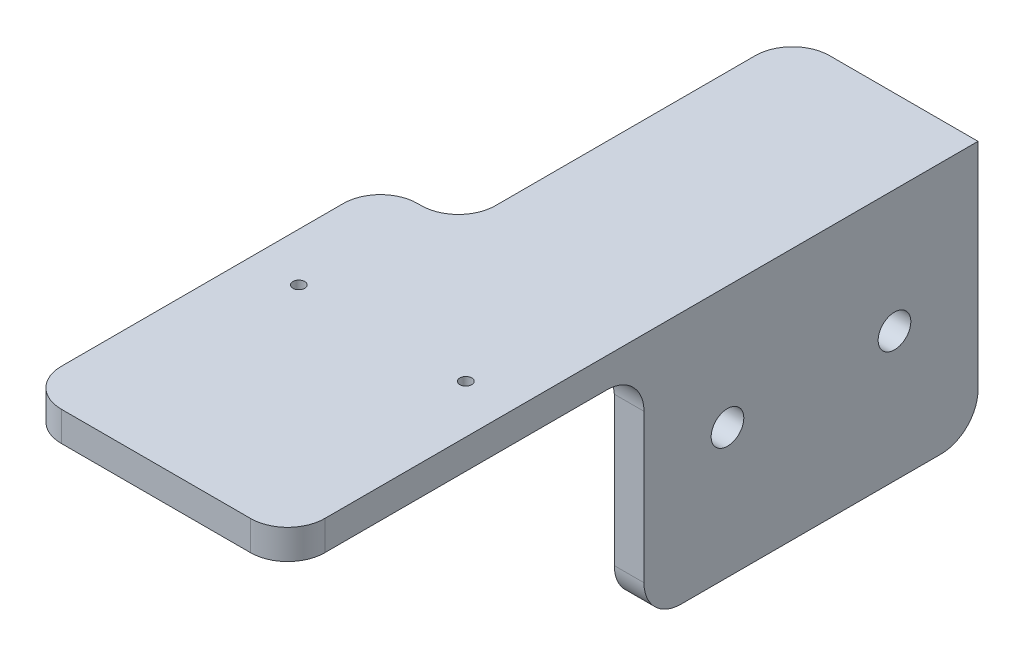
ISO-10303-21;
HEADER;
FILE_DESCRIPTION(('STEP AP214'),'2;1');
FILE_NAME('part.step','',(''),(''),'','','');
FILE_SCHEMA(('AUTOMOTIVE_DESIGN { 1 0 10303 214 1 1 1 1 }'));
ENDSEC;
DATA;
#1=APPLICATION_CONTEXT('core data for automotive mechanical design processes');
#2=APPLICATION_PROTOCOL_DEFINITION('international standard','automotive_design',2000,#1);
#3=PRODUCT_CONTEXT('',#1,'mechanical');
#4=PRODUCT('Part','Part','',(#3));
#5=PRODUCT_RELATED_PRODUCT_CATEGORY('part','',(#4));
#6=PRODUCT_DEFINITION_FORMATION('','',#4);
#7=PRODUCT_DEFINITION_CONTEXT('part definition',#1,'design');
#8=PRODUCT_DEFINITION('design','',#6,#7);
#9=PRODUCT_DEFINITION_SHAPE('','',#8);
#10=(LENGTH_UNIT() NAMED_UNIT(*) SI_UNIT(.MILLI.,.METRE.));
#11=(NAMED_UNIT(*) PLANE_ANGLE_UNIT() SI_UNIT($,.RADIAN.));
#12=(NAMED_UNIT(*) SI_UNIT($,.STERADIAN.) SOLID_ANGLE_UNIT());
#13=UNCERTAINTY_MEASURE_WITH_UNIT(LENGTH_MEASURE(1.E-05),#10,'distance_accuracy_value','');
#14=(GEOMETRIC_REPRESENTATION_CONTEXT(3) GLOBAL_UNCERTAINTY_ASSIGNED_CONTEXT((#13)) GLOBAL_UNIT_ASSIGNED_CONTEXT((#10,
#11,#12)) REPRESENTATION_CONTEXT('',''));
#15=CARTESIAN_POINT('',(0.,0.,0.));
#16=DIRECTION('',(0.,0.,1.));
#17=DIRECTION('',(1.,0.,0.));
#18=AXIS2_PLACEMENT_3D('',#15,#16,#17);
#19=CARTESIAN_POINT('',(35.5,-10.,-38.));
#20=DIRECTION('',(1.,0.,0.));
#21=DIRECTION('',(0.,0.,-1.));
#22=AXIS2_PLACEMENT_3D('',#19,#20,#21);
#23=CYLINDRICAL_SURFACE('',#22,10.);
#24=DIRECTION('',(-1.,0.,0.));
#25=VECTOR('',#24,1.);
#26=CARTESIAN_POINT('',(35.5,-10.,-48.));
#27=LINE('',#26,#25);
#28=CARTESIAN_POINT('',(35.5,-10.,-48.));
#29=VERTEX_POINT('',#28);
#30=CARTESIAN_POINT('',(27.5,-10.,-48.));
#31=VERTEX_POINT('',#30);
#32=EDGE_CURVE('E218',#29,#31,#27,.T.);
#33=ORIENTED_EDGE('',*,*,#32,.F.);
#34=CARTESIAN_POINT('',(35.5,-10.,-38.));
#35=DIRECTION('',(-1.,0.,0.));
#36=DIRECTION('',(0.,0.,1.));
#37=AXIS2_PLACEMENT_3D('',#34,#35,#36);
#38=CIRCLE('',#37,10.);
#39=CARTESIAN_POINT('',(35.5,0.,-38.));
#40=VERTEX_POINT('',#39);
#41=EDGE_CURVE('E46',#29,#40,#38,.F.);
#42=ORIENTED_EDGE('',*,*,#41,.T.);
#43=DIRECTION('',(-1.,0.,0.));
#44=VECTOR('',#43,1.);
#45=CARTESIAN_POINT('',(35.5,0.,-38.));
#46=LINE('',#45,#44);
#47=CARTESIAN_POINT('',(17.5,0.,-38.));
#48=VERTEX_POINT('',#47);
#49=EDGE_CURVE('E221',#48,#40,#46,.F.);
#50=ORIENTED_EDGE('',*,*,#49,.F.);
#51=CARTESIAN_POINT('',(17.5,-10.,-38.));
#52=DIRECTION('',(0.707106781186547,0.,0.707106781186547));
#53=DIRECTION('',(-0.707106781186547,0.,0.707106781186547));
#54=AXIS2_PLACEMENT_3D('',#51,#52,#53);
#55=ELLIPSE('',#54,14.1421356237309,10.);
#56=EDGE_CURVE('E11',#48,#31,#55,.F.);
#57=ORIENTED_EDGE('',*,*,#56,.T.);
#58=EDGE_LOOP('',(#33,#42,#50,#57));
#59=FACE_BOUND('',#58,.T.);
#60=ADVANCED_FACE('F39',(#59),#23,.F.);
#61=CARTESIAN_POINT('',(17.5,-10.,-138.));
#62=DIRECTION('',(0.,0.,1.));
#63=DIRECTION('',(1.,0.,0.));
#64=AXIS2_PLACEMENT_3D('',#61,#62,#63);
#65=CYLINDRICAL_SURFACE('',#64,10.);
#66=DIRECTION('',(0.,0.,-1.));
#67=VECTOR('',#66,1.);
#68=CARTESIAN_POINT('',(27.5,-10.,-138.));
#69=LINE('',#68,#67);
#70=CARTESIAN_POINT('',(27.5,-10.,-138.));
#71=VERTEX_POINT('',#70);
#72=EDGE_CURVE('E212',#31,#71,#69,.T.);
#73=ORIENTED_EDGE('',*,*,#72,.F.);
#74=ORIENTED_EDGE('',*,*,#56,.F.);
#75=DIRECTION('',(0.,0.,-1.));
#76=VECTOR('',#75,1.);
#77=CARTESIAN_POINT('',(17.5,0.,-138.));
#78=LINE('',#77,#76);
#79=CARTESIAN_POINT('',(17.5,0.,-138.));
#80=VERTEX_POINT('',#79);
#81=EDGE_CURVE('E53',#80,#48,#78,.F.);
#82=ORIENTED_EDGE('',*,*,#81,.F.);
#83=CARTESIAN_POINT('',(17.5,-10.,-138.));
#84=DIRECTION('',(0.,0.,1.));
#85=DIRECTION('',(1.,0.,0.));
#86=AXIS2_PLACEMENT_3D('',#83,#84,#85);
#87=CIRCLE('',#86,10.);
#88=EDGE_CURVE('E216',#80,#71,#87,.F.);
#89=ORIENTED_EDGE('',*,*,#88,.T.);
#90=EDGE_LOOP('',(#73,#74,#82,#89));
#91=FACE_BOUND('',#90,.T.);
#92=ADVANCED_FACE('F350',(#91),#65,.F.);
#93=CARTESIAN_POINT('',(0.,-50.,-58.));
#94=DIRECTION('',(1.,0.,0.));
#95=DIRECTION('',(0.,0.,-1.));
#96=AXIS2_PLACEMENT_3D('',#93,#94,#95);
#97=CYLINDRICAL_SURFACE('',#96,10.);
#98=DIRECTION('',(-1.,0.,0.));
#99=VECTOR('',#98,1.);
#100=CARTESIAN_POINT('',(0.,-60.,-58.));
#101=LINE('',#100,#99);
#102=CARTESIAN_POINT('',(35.5,-60.,-58.));
#103=VERTEX_POINT('',#102);
#104=CARTESIAN_POINT('',(27.5,-60.,-58.));
#105=VERTEX_POINT('',#104);
#106=EDGE_CURVE('E202',#103,#105,#101,.T.);
#107=ORIENTED_EDGE('',*,*,#106,.F.);
#108=CARTESIAN_POINT('',(35.5,-50.,-58.));
#109=DIRECTION('',(-1.,0.,0.));
#110=DIRECTION('',(0.,0.,1.));
#111=AXIS2_PLACEMENT_3D('',#108,#109,#110);
#112=CIRCLE('',#111,10.);
#113=CARTESIAN_POINT('',(35.5,-50.,-48.));
#114=VERTEX_POINT('',#113);
#115=EDGE_CURVE('E208',#114,#103,#112,.F.);
#116=ORIENTED_EDGE('',*,*,#115,.F.);
#117=DIRECTION('',(-1.,0.,0.));
#118=VECTOR('',#117,1.);
#119=CARTESIAN_POINT('',(0.,-50.,-48.));
#120=LINE('',#119,#118);
#121=CARTESIAN_POINT('',(27.5,-50.,-48.));
#122=VERTEX_POINT('',#121);
#123=EDGE_CURVE('E205',#122,#114,#120,.F.);
#124=ORIENTED_EDGE('',*,*,#123,.F.);
#125=CARTESIAN_POINT('',(27.5,-50.,-58.));
#126=DIRECTION('',(1.,0.,0.));
#127=DIRECTION('',(0.,0.,-1.));
#128=AXIS2_PLACEMENT_3D('',#125,#126,#127);
#129=CIRCLE('',#128,10.);
#130=EDGE_CURVE('E210',#105,#122,#129,.F.);
#131=ORIENTED_EDGE('',*,*,#130,.F.);
#132=EDGE_LOOP('',(#107,#116,#124,#131));
#133=FACE_BOUND('',#132,.T.);
#134=ADVANCED_FACE('F355',(#133),#97,.T.);
#135=CARTESIAN_POINT('',(0.,-50.,-128.));
#136=DIRECTION('',(-1.,0.,0.));
#137=DIRECTION('',(0.,0.,1.));
#138=AXIS2_PLACEMENT_3D('',#135,#136,#137);
#139=CYLINDRICAL_SURFACE('',#138,10.);
#140=DIRECTION('',(1.,0.,0.));
#141=VECTOR('',#140,1.);
#142=CARTESIAN_POINT('',(0.,-60.,-128.));
#143=LINE('',#142,#141);
#144=CARTESIAN_POINT('',(27.5,-60.,-128.));
#145=VERTEX_POINT('',#144);
#146=CARTESIAN_POINT('',(35.5,-60.,-128.));
#147=VERTEX_POINT('',#146);
#148=EDGE_CURVE('E188',#145,#147,#143,.T.);
#149=ORIENTED_EDGE('',*,*,#148,.F.);
#150=CARTESIAN_POINT('',(27.5,-50.,-128.));
#151=DIRECTION('',(1.,0.,0.));
#152=DIRECTION('',(0.,0.,-1.));
#153=AXIS2_PLACEMENT_3D('',#150,#151,#152);
#154=CIRCLE('',#153,10.);
#155=CARTESIAN_POINT('',(27.5,-50.,-138.));
#156=VERTEX_POINT('',#155);
#157=EDGE_CURVE('E198',#156,#145,#154,.F.);
#158=ORIENTED_EDGE('',*,*,#157,.F.);
#159=DIRECTION('',(1.,0.,0.));
#160=VECTOR('',#159,1.);
#161=CARTESIAN_POINT('',(0.,-50.,-138.));
#162=LINE('',#161,#160);
#163=CARTESIAN_POINT('',(35.5,-50.,-138.));
#164=VERTEX_POINT('',#163);
#165=EDGE_CURVE('E191',#164,#156,#162,.F.);
#166=ORIENTED_EDGE('',*,*,#165,.F.);
#167=CARTESIAN_POINT('',(35.5,-50.,-128.));
#168=DIRECTION('',(-1.,0.,0.));
#169=DIRECTION('',(0.,0.,1.));
#170=AXIS2_PLACEMENT_3D('',#167,#168,#169);
#171=CIRCLE('',#170,10.);
#172=EDGE_CURVE('E186',#147,#164,#171,.F.);
#173=ORIENTED_EDGE('',*,*,#172,.F.);
#174=EDGE_LOOP('',(#149,#158,#166,#173));
#175=FACE_BOUND('',#174,.T.);
#176=ADVANCED_FACE('F381',(#175),#139,.T.);
#177=CARTESIAN_POINT('',(-4.50000000000001,0.,-128.));
#178=DIRECTION('',(0.,1.,0.));
#179=DIRECTION('',(0.,0.,1.));
#180=AXIS2_PLACEMENT_3D('',#177,#178,#179);
#181=PLANE('',#180);
#182=CARTESIAN_POINT('',(22.5,0.,-13.));
#183=DIRECTION('',(0.,1.,0.));
#184=DIRECTION('',(0.,0.,1.));
#185=AXIS2_PLACEMENT_3D('',#182,#183,#184);
#186=CIRCLE('',#185,1.6);
#187=CARTESIAN_POINT('',(22.5,0.,-11.4));
#188=VERTEX_POINT('',#187);
#189=EDGE_CURVE('E306',#188,#188,#186,.T.);
#190=ORIENTED_EDGE('',*,*,#189,.T.);
#191=EDGE_LOOP('',(#190));
#192=FACE_BOUND('',#191,.T.);
#193=CARTESIAN_POINT('',(-22.5,0.,-13.));
#194=DIRECTION('',(0.,1.,0.));
#195=DIRECTION('',(0.,0.,1.));
#196=AXIS2_PLACEMENT_3D('',#193,#194,#195);
#197=CIRCLE('',#196,1.6);
#198=CARTESIAN_POINT('',(-22.5,0.,-11.4));
#199=VERTEX_POINT('',#198);
#200=EDGE_CURVE('E298',#199,#199,#197,.T.);
#201=ORIENTED_EDGE('',*,*,#200,.T.);
#202=EDGE_LOOP('',(#201));
#203=FACE_BOUND('',#202,.T.);
#204=ORIENTED_EDGE('',*,*,#81,.T.);
#205=ORIENTED_EDGE('',*,*,#49,.T.);
#206=DIRECTION('',(0.,0.,-1.));
#207=VECTOR('',#206,1.);
#208=CARTESIAN_POINT('',(35.5,0.,-48.));
#209=LINE('',#208,#207);
#210=CARTESIAN_POINT('',(35.5,0.,37.9999999999999));
#211=VERTEX_POINT('',#210);
#212=EDGE_CURVE('E181',#211,#40,#209,.T.);
#213=ORIENTED_EDGE('',*,*,#212,.F.);
#214=CARTESIAN_POINT('',(25.5,0.,38.));
#215=DIRECTION('',(0.,1.,0.));
#216=DIRECTION('',(0.,0.,-1.));
#217=AXIS2_PLACEMENT_3D('',#214,#215,#216);
#218=CIRCLE('',#217,10.);
#219=CARTESIAN_POINT('',(25.4999999999999,0.,48.));
#220=VERTEX_POINT('',#219);
#221=EDGE_CURVE('E227',#220,#211,#218,.T.);
#222=ORIENTED_EDGE('',*,*,#221,.F.);
#223=DIRECTION('',(1.,0.,0.));
#224=VECTOR('',#223,1.);
#225=CARTESIAN_POINT('',(-25.4999999999999,0.,48.));
#226=LINE('',#225,#224);
#227=CARTESIAN_POINT('',(-25.4999999999999,0.,48.));
#228=VERTEX_POINT('',#227);
#229=EDGE_CURVE('E229',#228,#220,#226,.T.);
#230=ORIENTED_EDGE('',*,*,#229,.F.);
#231=CARTESIAN_POINT('',(-25.5,0.,38.));
#232=DIRECTION('',(0.,1.,0.));
#233=DIRECTION('',(0.,0.,-1.));
#234=AXIS2_PLACEMENT_3D('',#231,#232,#233);
#235=CIRCLE('',#234,10.);
#236=CARTESIAN_POINT('',(-35.5,0.,37.9999999999999));
#237=VERTEX_POINT('',#236);
#238=EDGE_CURVE('E281',#237,#228,#235,.T.);
#239=ORIENTED_EDGE('',*,*,#238,.F.);
#240=DIRECTION('',(0.,0.,1.));
#241=VECTOR('',#240,1.);
#242=CARTESIAN_POINT('',(-35.5,0.,-37.9999999999999));
#243=LINE('',#242,#241);
#244=CARTESIAN_POINT('',(-35.5,0.,-37.9999999999999));
#245=VERTEX_POINT('',#244);
#246=EDGE_CURVE('E279',#245,#237,#243,.T.);
#247=ORIENTED_EDGE('',*,*,#246,.F.);
#248=CARTESIAN_POINT('',(-25.5,0.,-38.));
#249=DIRECTION('',(0.,1.,0.));
#250=DIRECTION('',(0.,0.,-1.));
#251=AXIS2_PLACEMENT_3D('',#248,#249,#250);
#252=CIRCLE('',#251,10.);
#253=CARTESIAN_POINT('',(-25.5,0.,-48.));
#254=VERTEX_POINT('',#253);
#255=EDGE_CURVE('E277',#254,#245,#252,.T.);
#256=ORIENTED_EDGE('',*,*,#255,.F.);
#257=DIRECTION('',(-1.,0.,0.));
#258=VECTOR('',#257,1.);
#259=CARTESIAN_POINT('',(-25.4999999999999,0.,-48.));
#260=LINE('',#259,#258);
#261=CARTESIAN_POINT('',(-24.5,0.,-48.));
#262=VERTEX_POINT('',#261);
#263=EDGE_CURVE('E270',#262,#254,#260,.T.);
#264=ORIENTED_EDGE('',*,*,#263,.F.);
#265=CARTESIAN_POINT('',(-24.5,0.,-58.));
#266=DIRECTION('',(0.,-1.,0.));
#267=DIRECTION('',(0.,0.,1.));
#268=AXIS2_PLACEMENT_3D('',#265,#266,#267);
#269=CIRCLE('',#268,10.);
#270=CARTESIAN_POINT('',(-14.5,0.,-58.));
#271=VERTEX_POINT('',#270);
#272=EDGE_CURVE('E268',#271,#262,#269,.T.);
#273=ORIENTED_EDGE('',*,*,#272,.F.);
#274=DIRECTION('',(0.,0.,1.));
#275=VECTOR('',#274,1.);
#276=CARTESIAN_POINT('',(-14.5,0.,-58.));
#277=LINE('',#276,#275);
#278=CARTESIAN_POINT('',(-14.5,0.,-128.));
#279=VERTEX_POINT('',#278);
#280=EDGE_CURVE('E261',#279,#271,#277,.T.);
#281=ORIENTED_EDGE('',*,*,#280,.F.);
#282=CARTESIAN_POINT('',(-4.50000000000001,0.,-128.));
#283=DIRECTION('',(0.,1.,0.));
#284=DIRECTION('',(0.,0.,1.));
#285=AXIS2_PLACEMENT_3D('',#282,#283,#284);
#286=CIRCLE('',#285,10.);
#287=CARTESIAN_POINT('',(-4.50000000000001,0.,-138.));
#288=VERTEX_POINT('',#287);
#289=EDGE_CURVE('E266',#288,#279,#286,.T.);
#290=ORIENTED_EDGE('',*,*,#289,.F.);
#291=DIRECTION('',(-1.,0.,0.));
#292=VECTOR('',#291,1.);
#293=CARTESIAN_POINT('',(35.5,0.,-138.));
#294=LINE('',#293,#292);
#295=EDGE_CURVE('E272',#80,#288,#294,.T.);
#296=ORIENTED_EDGE('',*,*,#295,.F.);
#297=EDGE_LOOP('',(#204,#205,#213,#222,#230,#239,#247,#256,#264,#273,#281,#290,#296));
#298=FACE_BOUND('',#297,.T.);
#299=ADVANCED_FACE('F224',(#192,#203,#298),#181,.F.);
#300=CARTESIAN_POINT('',(-4.50000000000001,8.,-128.));
#301=DIRECTION('',(0.,1.,0.));
#302=DIRECTION('',(0.,0.,1.));
#303=AXIS2_PLACEMENT_3D('',#300,#301,#302);
#304=PLANE('',#303);
#305=CARTESIAN_POINT('',(-22.5,8.,-13.));
#306=DIRECTION('',(0.,1.,0.));
#307=DIRECTION('',(0.,0.,1.));
#308=AXIS2_PLACEMENT_3D('',#305,#306,#307);
#309=CIRCLE('',#308,1.6);
#310=CARTESIAN_POINT('',(-22.5,8.,-11.4));
#311=VERTEX_POINT('',#310);
#312=EDGE_CURVE('E296',#311,#311,#309,.T.);
#313=ORIENTED_EDGE('',*,*,#312,.F.);
#314=EDGE_LOOP('',(#313));
#315=FACE_BOUND('',#314,.T.);
#316=DIRECTION('',(0.,0.,-1.));
#317=VECTOR('',#316,1.);
#318=CARTESIAN_POINT('',(35.5,8.,-48.));
#319=LINE('',#318,#317);
#320=CARTESIAN_POINT('',(35.5,8.,37.9999999999999));
#321=VERTEX_POINT('',#320);
#322=CARTESIAN_POINT('',(35.5,8.,-138.));
#323=VERTEX_POINT('',#322);
#324=EDGE_CURVE('E171',#321,#323,#319,.T.);
#325=ORIENTED_EDGE('',*,*,#324,.T.);
#326=DIRECTION('',(-1.,0.,0.));
#327=VECTOR('',#326,1.);
#328=CARTESIAN_POINT('',(35.5,8.,-138.));
#329=LINE('',#328,#327);
#330=CARTESIAN_POINT('',(-4.50000000000001,8.,-138.));
#331=VERTEX_POINT('',#330);
#332=EDGE_CURVE('E160',#323,#331,#329,.T.);
#333=ORIENTED_EDGE('',*,*,#332,.T.);
#334=CARTESIAN_POINT('',(-4.50000000000001,8.,-128.));
#335=DIRECTION('',(0.,1.,0.));
#336=DIRECTION('',(0.,0.,1.));
#337=AXIS2_PLACEMENT_3D('',#334,#335,#336);
#338=CIRCLE('',#337,10.);
#339=CARTESIAN_POINT('',(-14.5,8.,-128.));
#340=VERTEX_POINT('',#339);
#341=EDGE_CURVE('E170',#331,#340,#338,.T.);
#342=ORIENTED_EDGE('',*,*,#341,.T.);
#343=DIRECTION('',(0.,0.,1.));
#344=VECTOR('',#343,1.);
#345=CARTESIAN_POINT('',(-14.5,8.,-58.));
#346=LINE('',#345,#344);
#347=CARTESIAN_POINT('',(-14.5,8.,-58.));
#348=VERTEX_POINT('',#347);
#349=EDGE_CURVE('E262',#340,#348,#346,.T.);
#350=ORIENTED_EDGE('',*,*,#349,.T.);
#351=CARTESIAN_POINT('',(-24.5,8.,-58.));
#352=DIRECTION('',(0.,-1.,0.));
#353=DIRECTION('',(0.,0.,1.));
#354=AXIS2_PLACEMENT_3D('',#351,#352,#353);
#355=CIRCLE('',#354,10.);
#356=CARTESIAN_POINT('',(-24.5,8.,-48.));
#357=VERTEX_POINT('',#356);
#358=EDGE_CURVE('E311',#348,#357,#355,.T.);
#359=ORIENTED_EDGE('',*,*,#358,.T.);
#360=DIRECTION('',(-1.,0.,0.));
#361=VECTOR('',#360,1.);
#362=CARTESIAN_POINT('',(-25.4999999999999,8.,-48.));
#363=LINE('',#362,#361);
#364=CARTESIAN_POINT('',(-25.5,8.,-48.));
#365=VERTEX_POINT('',#364);
#366=EDGE_CURVE('E313',#357,#365,#363,.T.);
#367=ORIENTED_EDGE('',*,*,#366,.T.);
#368=CARTESIAN_POINT('',(-25.5,8.,-38.));
#369=DIRECTION('',(0.,1.,0.));
#370=DIRECTION('',(0.,0.,-1.));
#371=AXIS2_PLACEMENT_3D('',#368,#369,#370);
#372=CIRCLE('',#371,10.);
#373=CARTESIAN_POINT('',(-35.5,8.,-37.9999999999999));
#374=VERTEX_POINT('',#373);
#375=EDGE_CURVE('E315',#365,#374,#372,.T.);
#376=ORIENTED_EDGE('',*,*,#375,.T.);
#377=DIRECTION('',(0.,0.,1.));
#378=VECTOR('',#377,1.);
#379=CARTESIAN_POINT('',(-35.5,8.,-37.9999999999999));
#380=LINE('',#379,#378);
#381=CARTESIAN_POINT('',(-35.5,8.,37.9999999999999));
#382=VERTEX_POINT('',#381);
#383=EDGE_CURVE('E317',#374,#382,#380,.T.);
#384=ORIENTED_EDGE('',*,*,#383,.T.);
#385=CARTESIAN_POINT('',(-25.5,8.,38.));
#386=DIRECTION('',(0.,1.,0.));
#387=DIRECTION('',(0.,0.,-1.));
#388=AXIS2_PLACEMENT_3D('',#385,#386,#387);
#389=CIRCLE('',#388,10.);
#390=CARTESIAN_POINT('',(-25.4999999999999,8.,48.));
#391=VERTEX_POINT('',#390);
#392=EDGE_CURVE('E293',#382,#391,#389,.T.);
#393=ORIENTED_EDGE('',*,*,#392,.T.);
#394=DIRECTION('',(1.,0.,0.));
#395=VECTOR('',#394,1.);
#396=CARTESIAN_POINT('',(-25.4999999999999,8.,48.));
#397=LINE('',#396,#395);
#398=CARTESIAN_POINT('',(25.4999999999999,8.,48.));
#399=VERTEX_POINT('',#398);
#400=EDGE_CURVE('E291',#391,#399,#397,.T.);
#401=ORIENTED_EDGE('',*,*,#400,.T.);
#402=CARTESIAN_POINT('',(25.5,8.,38.));
#403=DIRECTION('',(0.,1.,0.));
#404=DIRECTION('',(0.,0.,-1.));
#405=AXIS2_PLACEMENT_3D('',#402,#403,#404);
#406=CIRCLE('',#405,10.);
#407=EDGE_CURVE('E177',#399,#321,#406,.T.);
#408=ORIENTED_EDGE('',*,*,#407,.T.);
#409=EDGE_LOOP('',(#325,#333,#342,#350,#359,#367,#376,#384,#393,#401,#408));
#410=FACE_BOUND('',#409,.T.);
#411=CARTESIAN_POINT('',(22.5,8.,-13.));
#412=DIRECTION('',(0.,1.,0.));
#413=DIRECTION('',(0.,0.,1.));
#414=AXIS2_PLACEMENT_3D('',#411,#412,#413);
#415=CIRCLE('',#414,1.6);
#416=CARTESIAN_POINT('',(22.5,8.,-11.4));
#417=VERTEX_POINT('',#416);
#418=EDGE_CURVE('E303',#417,#417,#415,.T.);
#419=ORIENTED_EDGE('',*,*,#418,.F.);
#420=EDGE_LOOP('',(#419));
#421=FACE_BOUND('',#420,.T.);
#422=ADVANCED_FACE('F174',(#315,#410,#421),#304,.T.);
#423=CARTESIAN_POINT('',(35.5,8.,-138.));
#424=DIRECTION('',(0.,0.,1.));
#425=DIRECTION('',(1.,0.,0.));
#426=AXIS2_PLACEMENT_3D('',#423,#424,#425);
#427=PLANE('',#426);
#428=ORIENTED_EDGE('',*,*,#88,.F.);
#429=ORIENTED_EDGE('',*,*,#295,.T.);
#430=DIRECTION('',(0.,-1.,0.));
#431=VECTOR('',#430,1.);
#432=CARTESIAN_POINT('',(-4.50000000000001,8.,-138.));
#433=LINE('',#432,#431);
#434=EDGE_CURVE('E167',#331,#288,#433,.T.);
#435=ORIENTED_EDGE('',*,*,#434,.F.);
#436=ORIENTED_EDGE('',*,*,#332,.F.);
#437=DIRECTION('',(0.,-1.,0.));
#438=VECTOR('',#437,1.);
#439=CARTESIAN_POINT('',(35.5,8.,-138.));
#440=LINE('',#439,#438);
#441=EDGE_CURVE('E165',#323,#164,#440,.T.);
#442=ORIENTED_EDGE('',*,*,#441,.T.);
#443=ORIENTED_EDGE('',*,*,#165,.T.);
#444=DIRECTION('',(0.,1.,0.));
#445=VECTOR('',#444,1.);
#446=CARTESIAN_POINT('',(27.5,-60.,-138.));
#447=LINE('',#446,#445);
#448=EDGE_CURVE('E368',#156,#71,#447,.T.);
#449=ORIENTED_EDGE('',*,*,#448,.T.);
#450=EDGE_LOOP('',(#428,#429,#435,#436,#442,#443,#449));
#451=FACE_BOUND('',#450,.T.);
#452=ADVANCED_FACE('F162',(#451),#427,.F.);
#453=CARTESIAN_POINT('',(-4.50000000000001,8.,-128.));
#454=DIRECTION('',(0.,-1.,0.));
#455=DIRECTION('',(0.,0.,-1.));
#456=AXIS2_PLACEMENT_3D('',#453,#454,#455);
#457=CYLINDRICAL_SURFACE('',#456,10.);
#458=ORIENTED_EDGE('',*,*,#289,.T.);
#459=DIRECTION('',(0.,-1.,0.));
#460=VECTOR('',#459,1.);
#461=CARTESIAN_POINT('',(-14.5,8.,-128.));
#462=LINE('',#461,#460);
#463=EDGE_CURVE('E193',#340,#279,#462,.T.);
#464=ORIENTED_EDGE('',*,*,#463,.F.);
#465=ORIENTED_EDGE('',*,*,#341,.F.);
#466=ORIENTED_EDGE('',*,*,#434,.T.);
#467=EDGE_LOOP('',(#458,#464,#465,#466));
#468=FACE_BOUND('',#467,.T.);
#469=ADVANCED_FACE('F339',(#468),#457,.T.);
#470=CARTESIAN_POINT('',(-14.5,8.,-58.));
#471=DIRECTION('',(1.,0.,0.));
#472=DIRECTION('',(0.,0.,-1.));
#473=AXIS2_PLACEMENT_3D('',#470,#471,#472);
#474=PLANE('',#473);
#475=ORIENTED_EDGE('',*,*,#280,.T.);
#476=DIRECTION('',(0.,-1.,0.));
#477=VECTOR('',#476,1.);
#478=CARTESIAN_POINT('',(-14.5,8.,-58.));
#479=LINE('',#478,#477);
#480=EDGE_CURVE('E252',#348,#271,#479,.T.);
#481=ORIENTED_EDGE('',*,*,#480,.F.);
#482=ORIENTED_EDGE('',*,*,#349,.F.);
#483=ORIENTED_EDGE('',*,*,#463,.T.);
#484=EDGE_LOOP('',(#475,#481,#482,#483));
#485=FACE_BOUND('',#484,.T.);
#486=ADVANCED_FACE('F259',(#485),#474,.F.);
#487=CARTESIAN_POINT('',(-24.5,8.,-58.));
#488=DIRECTION('',(0.,-1.,0.));
#489=DIRECTION('',(0.,0.,-1.));
#490=AXIS2_PLACEMENT_3D('',#487,#488,#489);
#491=CYLINDRICAL_SURFACE('',#490,10.);
#492=ORIENTED_EDGE('',*,*,#272,.T.);
#493=DIRECTION('',(0.,-1.,0.));
#494=VECTOR('',#493,1.);
#495=CARTESIAN_POINT('',(-24.5,8.,-48.));
#496=LINE('',#495,#494);
#497=EDGE_CURVE('E249',#357,#262,#496,.T.);
#498=ORIENTED_EDGE('',*,*,#497,.F.);
#499=ORIENTED_EDGE('',*,*,#358,.F.);
#500=ORIENTED_EDGE('',*,*,#480,.T.);
#501=EDGE_LOOP('',(#492,#498,#499,#500));
#502=FACE_BOUND('',#501,.T.);
#503=ADVANCED_FACE('F338',(#502),#491,.F.);
#504=CARTESIAN_POINT('',(-25.4999999999999,8.,-48.));
#505=DIRECTION('',(0.,0.,1.));
#506=DIRECTION('',(1.,0.,0.));
#507=AXIS2_PLACEMENT_3D('',#504,#505,#506);
#508=PLANE('',#507);
#509=ORIENTED_EDGE('',*,*,#263,.T.);
#510=DIRECTION('',(0.,-1.,0.));
#511=VECTOR('',#510,1.);
#512=CARTESIAN_POINT('',(-25.5,8.,-48.));
#513=LINE('',#512,#511);
#514=EDGE_CURVE('E246',#365,#254,#513,.T.);
#515=ORIENTED_EDGE('',*,*,#514,.F.);
#516=ORIENTED_EDGE('',*,*,#366,.F.);
#517=ORIENTED_EDGE('',*,*,#497,.T.);
#518=EDGE_LOOP('',(#509,#515,#516,#517));
#519=FACE_BOUND('',#518,.T.);
#520=ADVANCED_FACE('F334',(#519),#508,.F.);
#521=CARTESIAN_POINT('',(-25.5,8.,-38.));
#522=DIRECTION('',(0.,-1.,0.));
#523=DIRECTION('',(0.,0.,-1.));
#524=AXIS2_PLACEMENT_3D('',#521,#522,#523);
#525=CYLINDRICAL_SURFACE('',#524,10.);
#526=ORIENTED_EDGE('',*,*,#255,.T.);
#527=DIRECTION('',(0.,-1.,0.));
#528=VECTOR('',#527,1.);
#529=CARTESIAN_POINT('',(-35.5,8.,-37.9999999999999));
#530=LINE('',#529,#528);
#531=EDGE_CURVE('E243',#374,#245,#530,.T.);
#532=ORIENTED_EDGE('',*,*,#531,.F.);
#533=ORIENTED_EDGE('',*,*,#375,.F.);
#534=ORIENTED_EDGE('',*,*,#514,.T.);
#535=EDGE_LOOP('',(#526,#532,#533,#534));
#536=FACE_BOUND('',#535,.T.);
#537=ADVANCED_FACE('F330',(#536),#525,.T.);
#538=CARTESIAN_POINT('',(-35.5,8.,-37.9999999999999));
#539=DIRECTION('',(1.,0.,0.));
#540=DIRECTION('',(0.,0.,-1.));
#541=AXIS2_PLACEMENT_3D('',#538,#539,#540);
#542=PLANE('',#541);
#543=ORIENTED_EDGE('',*,*,#246,.T.);
#544=DIRECTION('',(0.,-1.,0.));
#545=VECTOR('',#544,1.);
#546=CARTESIAN_POINT('',(-35.5,8.,37.9999999999999));
#547=LINE('',#546,#545);
#548=EDGE_CURVE('E240',#382,#237,#547,.T.);
#549=ORIENTED_EDGE('',*,*,#548,.F.);
#550=ORIENTED_EDGE('',*,*,#383,.F.);
#551=ORIENTED_EDGE('',*,*,#531,.T.);
#552=EDGE_LOOP('',(#543,#549,#550,#551));
#553=FACE_BOUND('',#552,.T.);
#554=ADVANCED_FACE('F326',(#553),#542,.F.);
#555=CARTESIAN_POINT('',(-25.5,8.,38.));
#556=DIRECTION('',(0.,-1.,0.));
#557=DIRECTION('',(0.,0.,-1.));
#558=AXIS2_PLACEMENT_3D('',#555,#556,#557);
#559=CYLINDRICAL_SURFACE('',#558,10.);
#560=ORIENTED_EDGE('',*,*,#238,.T.);
#561=DIRECTION('',(0.,-1.,0.));
#562=VECTOR('',#561,1.);
#563=CARTESIAN_POINT('',(-25.4999999999999,8.,48.));
#564=LINE('',#563,#562);
#565=EDGE_CURVE('E237',#391,#228,#564,.T.);
#566=ORIENTED_EDGE('',*,*,#565,.F.);
#567=ORIENTED_EDGE('',*,*,#392,.F.);
#568=ORIENTED_EDGE('',*,*,#548,.T.);
#569=EDGE_LOOP('',(#560,#566,#567,#568));
#570=FACE_BOUND('',#569,.T.);
#571=ADVANCED_FACE('F322',(#570),#559,.T.);
#572=CARTESIAN_POINT('',(-25.4999999999999,8.,48.));
#573=DIRECTION('',(0.,0.,-1.));
#574=DIRECTION('',(-1.,0.,0.));
#575=AXIS2_PLACEMENT_3D('',#572,#573,#574);
#576=PLANE('',#575);
#577=ORIENTED_EDGE('',*,*,#229,.T.);
#578=DIRECTION('',(0.,-1.,0.));
#579=VECTOR('',#578,1.);
#580=CARTESIAN_POINT('',(25.4999999999999,8.,48.));
#581=LINE('',#580,#579);
#582=EDGE_CURVE('E234',#399,#220,#581,.T.);
#583=ORIENTED_EDGE('',*,*,#582,.F.);
#584=ORIENTED_EDGE('',*,*,#400,.F.);
#585=ORIENTED_EDGE('',*,*,#565,.T.);
#586=EDGE_LOOP('',(#577,#583,#584,#585));
#587=FACE_BOUND('',#586,.T.);
#588=ADVANCED_FACE('F285',(#587),#576,.F.);
#589=CARTESIAN_POINT('',(25.5,8.,38.));
#590=DIRECTION('',(0.,-1.,0.));
#591=DIRECTION('',(0.,0.,-1.));
#592=AXIS2_PLACEMENT_3D('',#589,#590,#591);
#593=CYLINDRICAL_SURFACE('',#592,10.);
#594=ORIENTED_EDGE('',*,*,#221,.T.);
#595=DIRECTION('',(0.,-1.,0.));
#596=VECTOR('',#595,1.);
#597=CARTESIAN_POINT('',(35.5,8.,37.9999999999999));
#598=LINE('',#597,#596);
#599=EDGE_CURVE('E226',#321,#211,#598,.T.);
#600=ORIENTED_EDGE('',*,*,#599,.F.);
#601=ORIENTED_EDGE('',*,*,#407,.F.);
#602=ORIENTED_EDGE('',*,*,#582,.T.);
#603=EDGE_LOOP('',(#594,#600,#601,#602));
#604=FACE_BOUND('',#603,.T.);
#605=ADVANCED_FACE('F290',(#604),#593,.T.);
#606=CARTESIAN_POINT('',(35.5,8.,-48.));
#607=DIRECTION('',(-1.,0.,0.));
#608=DIRECTION('',(0.,0.,1.));
#609=AXIS2_PLACEMENT_3D('',#606,#607,#608);
#610=PLANE('',#609);
#611=CARTESIAN_POINT('',(35.5,-25.,-70.5));
#612=DIRECTION('',(1.,0.,0.));
#613=DIRECTION('',(0.,0.,-1.));
#614=AXIS2_PLACEMENT_3D('',#611,#612,#613);
#615=CIRCLE('',#614,4.4);
#616=CARTESIAN_POINT('',(35.5,-25.,-74.9));
#617=VERTEX_POINT('',#616);
#618=EDGE_CURVE('E593',#617,#617,#615,.T.);
#619=ORIENTED_EDGE('',*,*,#618,.F.);
#620=EDGE_LOOP('',(#619));
#621=FACE_BOUND('',#620,.T.);
#622=CARTESIAN_POINT('',(35.5,-25.,-115.5));
#623=DIRECTION('',(1.,0.,0.));
#624=DIRECTION('',(0.,0.,-1.));
#625=AXIS2_PLACEMENT_3D('',#622,#623,#624);
#626=CIRCLE('',#625,4.4);
#627=CARTESIAN_POINT('',(35.5,-25.,-119.9));
#628=VERTEX_POINT('',#627);
#629=EDGE_CURVE('E596',#628,#628,#626,.T.);
#630=ORIENTED_EDGE('',*,*,#629,.F.);
#631=EDGE_LOOP('',(#630));
#632=FACE_BOUND('',#631,.T.);
#633=DIRECTION('',(0.,1.,0.));
#634=VECTOR('',#633,1.);
#635=CARTESIAN_POINT('',(35.5,-60.,-48.));
#636=LINE('',#635,#634);
#637=EDGE_CURVE('E361',#114,#29,#636,.T.);
#638=ORIENTED_EDGE('',*,*,#637,.F.);
#639=ORIENTED_EDGE('',*,*,#115,.T.);
#640=DIRECTION('',(0.,0.,1.));
#641=VECTOR('',#640,1.);
#642=CARTESIAN_POINT('',(35.5,-60.,-138.));
#643=LINE('',#642,#641);
#644=EDGE_CURVE('E590',#147,#103,#643,.T.);
#645=ORIENTED_EDGE('',*,*,#644,.F.);
#646=ORIENTED_EDGE('',*,*,#172,.T.);
#647=ORIENTED_EDGE('',*,*,#441,.F.);
#648=ORIENTED_EDGE('',*,*,#324,.F.);
#649=ORIENTED_EDGE('',*,*,#599,.T.);
#650=ORIENTED_EDGE('',*,*,#212,.T.);
#651=ORIENTED_EDGE('',*,*,#41,.F.);
#652=EDGE_LOOP('',(#638,#639,#645,#646,#647,#648,#649,#650,#651));
#653=FACE_BOUND('',#652,.T.);
#654=ADVANCED_FACE('F184',(#621,#632,#653),#610,.F.);
#655=CARTESIAN_POINT('',(-22.5,8.,-13.));
#656=DIRECTION('',(0.,-1.,0.));
#657=DIRECTION('',(0.,0.,-1.));
#658=AXIS2_PLACEMENT_3D('',#655,#656,#657);
#659=CYLINDRICAL_SURFACE('',#658,1.6);
#660=ORIENTED_EDGE('',*,*,#312,.T.);
#661=EDGE_LOOP('',(#660));
#662=FACE_BOUND('',#661,.T.);
#663=ORIENTED_EDGE('',*,*,#200,.F.);
#664=EDGE_LOOP('',(#663));
#665=FACE_BOUND('',#664,.T.);
#666=ADVANCED_FACE('F385',(#662,#665),#659,.F.);
#667=CARTESIAN_POINT('',(22.5,8.,-13.));
#668=DIRECTION('',(0.,-1.,0.));
#669=DIRECTION('',(0.,0.,-1.));
#670=AXIS2_PLACEMENT_3D('',#667,#668,#669);
#671=CYLINDRICAL_SURFACE('',#670,1.6);
#672=ORIENTED_EDGE('',*,*,#418,.T.);
#673=EDGE_LOOP('',(#672));
#674=FACE_BOUND('',#673,.T.);
#675=ORIENTED_EDGE('',*,*,#189,.F.);
#676=EDGE_LOOP('',(#675));
#677=FACE_BOUND('',#676,.T.);
#678=ADVANCED_FACE('F374',(#674,#677),#671,.F.);
#679=CARTESIAN_POINT('',(35.5,-60.,-48.));
#680=DIRECTION('',(0.,0.,-1.));
#681=DIRECTION('',(-1.,0.,0.));
#682=AXIS2_PLACEMENT_3D('',#679,#680,#681);
#683=PLANE('',#682);
#684=ORIENTED_EDGE('',*,*,#637,.T.);
#685=ORIENTED_EDGE('',*,*,#32,.T.);
#686=DIRECTION('',(0.,1.,0.));
#687=VECTOR('',#686,1.);
#688=CARTESIAN_POINT('',(27.5,-60.,-48.));
#689=LINE('',#688,#687);
#690=EDGE_CURVE('E364',#122,#31,#689,.T.);
#691=ORIENTED_EDGE('',*,*,#690,.F.);
#692=ORIENTED_EDGE('',*,*,#123,.T.);
#693=EDGE_LOOP('',(#684,#685,#691,#692));
#694=FACE_BOUND('',#693,.T.);
#695=ADVANCED_FACE('F362',(#694),#683,.F.);
#696=CARTESIAN_POINT('',(27.5,-60.,-138.));
#697=DIRECTION('',(1.,0.,0.));
#698=DIRECTION('',(0.,0.,-1.));
#699=AXIS2_PLACEMENT_3D('',#696,#697,#698);
#700=PLANE('',#699);
#701=CARTESIAN_POINT('',(27.5,-25.,-70.5));
#702=DIRECTION('',(1.,0.,0.));
#703=DIRECTION('',(0.,0.,-1.));
#704=AXIS2_PLACEMENT_3D('',#701,#702,#703);
#705=CIRCLE('',#704,4.4);
#706=CARTESIAN_POINT('',(27.5,-25.,-74.9));
#707=VERTEX_POINT('',#706);
#708=EDGE_CURVE('E579',#707,#707,#705,.F.);
#709=ORIENTED_EDGE('',*,*,#708,.F.);
#710=EDGE_LOOP('',(#709));
#711=FACE_BOUND('',#710,.T.);
#712=CARTESIAN_POINT('',(27.5,-25.,-115.5));
#713=DIRECTION('',(1.,0.,0.));
#714=DIRECTION('',(0.,0.,-1.));
#715=AXIS2_PLACEMENT_3D('',#712,#713,#714);
#716=CIRCLE('',#715,4.4);
#717=CARTESIAN_POINT('',(27.5,-25.,-119.9));
#718=VERTEX_POINT('',#717);
#719=EDGE_CURVE('E583',#718,#718,#716,.F.);
#720=ORIENTED_EDGE('',*,*,#719,.F.);
#721=EDGE_LOOP('',(#720));
#722=FACE_BOUND('',#721,.T.);
#723=ORIENTED_EDGE('',*,*,#690,.T.);
#724=ORIENTED_EDGE('',*,*,#72,.T.);
#725=ORIENTED_EDGE('',*,*,#448,.F.);
#726=ORIENTED_EDGE('',*,*,#157,.T.);
#727=DIRECTION('',(0.,0.,-1.));
#728=VECTOR('',#727,1.);
#729=CARTESIAN_POINT('',(27.5,-60.,-138.));
#730=LINE('',#729,#728);
#731=EDGE_CURVE('E587',#105,#145,#730,.T.);
#732=ORIENTED_EDGE('',*,*,#731,.F.);
#733=ORIENTED_EDGE('',*,*,#130,.T.);
#734=EDGE_LOOP('',(#723,#724,#725,#726,#732,#733));
#735=FACE_BOUND('',#734,.T.);
#736=ADVANCED_FACE('F479',(#711,#722,#735),#700,.F.);
#737=CARTESIAN_POINT('',(0.,-60.,0.));
#738=DIRECTION('',(0.,-1.,0.));
#739=DIRECTION('',(0.,0.,-1.));
#740=AXIS2_PLACEMENT_3D('',#737,#738,#739);
#741=PLANE('',#740);
#742=ORIENTED_EDGE('',*,*,#644,.T.);
#743=ORIENTED_EDGE('',*,*,#106,.T.);
#744=ORIENTED_EDGE('',*,*,#731,.T.);
#745=ORIENTED_EDGE('',*,*,#148,.T.);
#746=EDGE_LOOP('',(#742,#743,#744,#745));
#747=FACE_BOUND('',#746,.T.);
#748=ADVANCED_FACE('F475',(#747),#741,.T.);
#749=CARTESIAN_POINT('',(15.0549206511168,-25.,-115.5));
#750=DIRECTION('',(1.,0.,0.));
#751=DIRECTION('',(0.,0.,-1.));
#752=AXIS2_PLACEMENT_3D('',#749,#750,#751);
#753=CYLINDRICAL_SURFACE('',#752,4.4);
#754=ORIENTED_EDGE('',*,*,#719,.T.);
#755=EDGE_LOOP('',(#754));
#756=FACE_BOUND('',#755,.T.);
#757=ORIENTED_EDGE('',*,*,#629,.T.);
#758=EDGE_LOOP('',(#757));
#759=FACE_BOUND('',#758,.T.);
#760=ADVANCED_FACE('F478',(#756,#759),#753,.F.);
#761=CARTESIAN_POINT('',(15.0549206511168,-25.,-70.5));
#762=DIRECTION('',(1.,0.,0.));
#763=DIRECTION('',(0.,0.,-1.));
#764=AXIS2_PLACEMENT_3D('',#761,#762,#763);
#765=CYLINDRICAL_SURFACE('',#764,4.4);
#766=ORIENTED_EDGE('',*,*,#708,.T.);
#767=EDGE_LOOP('',(#766));
#768=FACE_BOUND('',#767,.T.);
#769=ORIENTED_EDGE('',*,*,#618,.T.);
#770=EDGE_LOOP('',(#769));
#771=FACE_BOUND('',#770,.T.);
#772=ADVANCED_FACE('F488',(#768,#771),#765,.F.);
#773=CLOSED_SHELL('',(#60,#92,#134,#176,#299,#422,#452,#469,#486,#503,#520,#537,#554,#571,#588,
#605,#654,#666,#678,#695,#736,#748,#760,#772));
#774=MANIFOLD_SOLID_BREP('B2',#773);
#775=ADVANCED_BREP_SHAPE_REPRESENTATION('',(#18,#774),#14);
#776=SHAPE_DEFINITION_REPRESENTATION(#9,#775);
ENDSEC;
END-ISO-10303-21;
